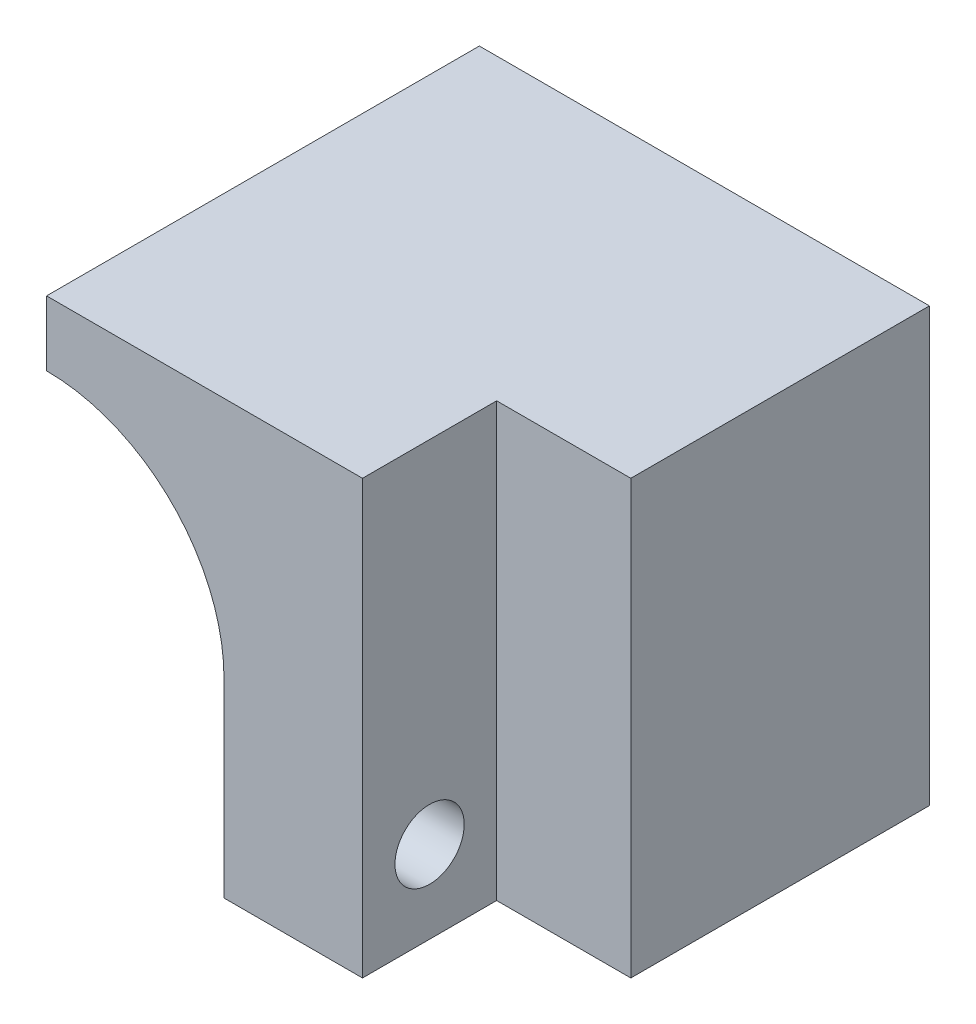
ISO-10303-21;
HEADER;
FILE_DESCRIPTION(('STEP AP214'),'2;1');
FILE_NAME('part.step','',(''),(''),'','','');
FILE_SCHEMA(('AUTOMOTIVE_DESIGN { 1 0 10303 214 1 1 1 1 }'));
ENDSEC;
DATA;
#1=APPLICATION_CONTEXT('core data for automotive mechanical design processes');
#2=APPLICATION_PROTOCOL_DEFINITION('international standard','automotive_design',2000,#1);
#3=PRODUCT_CONTEXT('',#1,'mechanical');
#4=PRODUCT('Part','Part','',(#3));
#5=PRODUCT_RELATED_PRODUCT_CATEGORY('part','',(#4));
#6=PRODUCT_DEFINITION_FORMATION('','',#4);
#7=PRODUCT_DEFINITION_CONTEXT('part definition',#1,'design');
#8=PRODUCT_DEFINITION('design','',#6,#7);
#9=PRODUCT_DEFINITION_SHAPE('','',#8);
#10=(LENGTH_UNIT() NAMED_UNIT(*) SI_UNIT(.MILLI.,.METRE.));
#11=(NAMED_UNIT(*) PLANE_ANGLE_UNIT() SI_UNIT($,.RADIAN.));
#12=(NAMED_UNIT(*) SI_UNIT($,.STERADIAN.) SOLID_ANGLE_UNIT());
#13=UNCERTAINTY_MEASURE_WITH_UNIT(LENGTH_MEASURE(1.E-05),#10,'distance_accuracy_value','');
#14=(GEOMETRIC_REPRESENTATION_CONTEXT(3) GLOBAL_UNCERTAINTY_ASSIGNED_CONTEXT((#13)) GLOBAL_UNIT_ASSIGNED_CONTEXT((#10,
#11,#12)) REPRESENTATION_CONTEXT('',''));
#15=CARTESIAN_POINT('',(0.,0.,0.));
#16=DIRECTION('',(0.,0.,1.));
#17=DIRECTION('',(1.,0.,0.));
#18=AXIS2_PLACEMENT_3D('',#15,#16,#17);
#19=CARTESIAN_POINT('',(-0.00104999999999897,-16.2,16.9));
#20=DIRECTION('',(1.,0.,0.));
#21=DIRECTION('',(0.,0.,-1.));
#22=AXIS2_PLACEMENT_3D('',#19,#20,#21);
#23=CYLINDRICAL_SURFACE('',#22,1.6);
#24=CARTESIAN_POINT('',(14.6,-16.2,16.9));
#25=DIRECTION('',(1.,0.,0.));
#26=DIRECTION('',(0.,0.,-1.));
#27=AXIS2_PLACEMENT_3D('',#24,#25,#26);
#28=CIRCLE('',#27,1.6);
#29=CARTESIAN_POINT('',(14.6,-16.2,15.3));
#30=VERTEX_POINT('',#29);
#31=EDGE_CURVE('E195',#30,#30,#28,.T.);
#32=ORIENTED_EDGE('',*,*,#31,.T.);
#33=EDGE_LOOP('',(#32));
#34=FACE_BOUND('',#33,.T.);
#35=CARTESIAN_POINT('',(11.2,-16.2,16.9));
#36=DIRECTION('',(-1.,0.,0.));
#37=DIRECTION('',(0.,0.,1.));
#38=AXIS2_PLACEMENT_3D('',#35,#36,#37);
#39=CIRCLE('',#38,1.6);
#40=CARTESIAN_POINT('',(11.2,-16.2,18.5));
#41=VERTEX_POINT('',#40);
#42=EDGE_CURVE('E35',#41,#41,#39,.F.);
#43=ORIENTED_EDGE('',*,*,#42,.F.);
#44=EDGE_LOOP('',(#43));
#45=FACE_BOUND('',#44,.T.);
#46=ADVANCED_FACE('F31',(#34,#45),#23,.F.);
#47=CARTESIAN_POINT('',(0.,-11.2,13.8));
#48=DIRECTION('',(0.,0.,-1.));
#49=DIRECTION('',(-1.,0.,0.));
#50=AXIS2_PLACEMENT_3D('',#47,#48,#49);
#51=PLANE('',#50);
#52=DIRECTION('',(0.,1.,0.));
#53=VECTOR('',#52,1.);
#54=CARTESIAN_POINT('',(14.6,-20.,13.8));
#55=LINE('',#54,#53);
#56=CARTESIAN_POINT('',(14.6,-20.,13.8));
#57=VERTEX_POINT('',#56);
#58=CARTESIAN_POINT('',(14.6,0.,13.8));
#59=VERTEX_POINT('',#58);
#60=EDGE_CURVE('E56',#57,#59,#55,.T.);
#61=ORIENTED_EDGE('',*,*,#60,.F.);
#62=DIRECTION('',(1.,0.,0.));
#63=VECTOR('',#62,1.);
#64=CARTESIAN_POINT('',(8.2,-20.,13.8));
#65=LINE('',#64,#63);
#66=CARTESIAN_POINT('',(20.8,-20.,13.8));
#67=VERTEX_POINT('',#66);
#68=EDGE_CURVE('E222',#57,#67,#65,.T.);
#69=ORIENTED_EDGE('',*,*,#68,.T.);
#70=DIRECTION('',(0.,1.,0.));
#71=VECTOR('',#70,1.);
#72=CARTESIAN_POINT('',(20.8,-20.,13.8));
#73=LINE('',#72,#71);
#74=CARTESIAN_POINT('',(20.8,0.,13.8));
#75=VERTEX_POINT('',#74);
#76=EDGE_CURVE('E263',#67,#75,#73,.T.);
#77=ORIENTED_EDGE('',*,*,#76,.T.);
#78=DIRECTION('',(-1.,0.,0.));
#79=VECTOR('',#78,1.);
#80=CARTESIAN_POINT('',(20.8,0.,13.8));
#81=LINE('',#80,#79);
#82=EDGE_CURVE('E242',#75,#59,#81,.T.);
#83=ORIENTED_EDGE('',*,*,#82,.T.);
#84=EDGE_LOOP('',(#61,#69,#77,#83));
#85=FACE_BOUND('',#84,.T.);
#86=ADVANCED_FACE('F317',(#85),#51,.F.);
#87=CARTESIAN_POINT('',(0.,0.,2.));
#88=DIRECTION('',(1.,0.,0.));
#89=DIRECTION('',(0.,1.,0.));
#90=AXIS2_PLACEMENT_3D('',#87,#88,#89);
#91=PLANE('',#90);
#92=DIRECTION('',(0.,-1.,0.));
#93=VECTOR('',#92,1.);
#94=CARTESIAN_POINT('',(0.,0.,0.));
#95=LINE('',#94,#93);
#96=CARTESIAN_POINT('',(0.,0.,0.));
#97=VERTEX_POINT('',#96);
#98=CARTESIAN_POINT('',(0.,-20.,0.));
#99=VERTEX_POINT('',#98);
#100=EDGE_CURVE('E253',#97,#99,#95,.T.);
#101=ORIENTED_EDGE('',*,*,#100,.T.);
#102=DIRECTION('',(0.,0.,-1.));
#103=VECTOR('',#102,1.);
#104=CARTESIAN_POINT('',(0.,-20.,2.));
#105=LINE('',#104,#103);
#106=CARTESIAN_POINT('',(0.,-20.,2.));
#107=VERTEX_POINT('',#106);
#108=EDGE_CURVE('E11',#107,#99,#105,.T.);
#109=ORIENTED_EDGE('',*,*,#108,.F.);
#110=DIRECTION('',(0.,-1.,0.));
#111=VECTOR('',#110,1.);
#112=CARTESIAN_POINT('',(0.,0.,2.));
#113=LINE('',#112,#111);
#114=CARTESIAN_POINT('',(0.,-3.,2.));
#115=VERTEX_POINT('',#114);
#116=EDGE_CURVE('E268',#115,#107,#113,.T.);
#117=ORIENTED_EDGE('',*,*,#116,.F.);
#118=DIRECTION('',(0.,0.,-1.));
#119=VECTOR('',#118,1.);
#120=CARTESIAN_POINT('',(0.,-3.,13.8));
#121=LINE('',#120,#119);
#122=CARTESIAN_POINT('',(0.,-3.,20.));
#123=VERTEX_POINT('',#122);
#124=EDGE_CURVE('E251',#123,#115,#121,.T.);
#125=ORIENTED_EDGE('',*,*,#124,.F.);
#126=DIRECTION('',(0.,-1.,0.));
#127=VECTOR('',#126,1.);
#128=CARTESIAN_POINT('',(0.,0.,20.));
#129=LINE('',#128,#127);
#130=CARTESIAN_POINT('',(0.,0.,20.));
#131=VERTEX_POINT('',#130);
#132=EDGE_CURVE('E198',#131,#123,#129,.T.);
#133=ORIENTED_EDGE('',*,*,#132,.F.);
#134=DIRECTION('',(0.,0.,-1.));
#135=VECTOR('',#134,1.);
#136=CARTESIAN_POINT('',(0.,0.,2.));
#137=LINE('',#136,#135);
#138=EDGE_CURVE('E276',#131,#97,#137,.T.);
#139=ORIENTED_EDGE('',*,*,#138,.T.);
#140=EDGE_LOOP('',(#101,#109,#117,#125,#133,#139));
#141=FACE_BOUND('',#140,.T.);
#142=ADVANCED_FACE('F33',(#141),#91,.F.);
#143=CARTESIAN_POINT('',(0.,-20.,2.));
#144=DIRECTION('',(0.,1.,0.));
#145=DIRECTION('',(0.,0.,1.));
#146=AXIS2_PLACEMENT_3D('',#143,#144,#145);
#147=PLANE('',#146);
#148=DIRECTION('',(1.,0.,0.));
#149=VECTOR('',#148,1.);
#150=CARTESIAN_POINT('',(0.,-20.,0.));
#151=LINE('',#150,#149);
#152=CARTESIAN_POINT('',(20.8,-20.,0.));
#153=VERTEX_POINT('',#152);
#154=EDGE_CURVE('E282',#99,#153,#151,.T.);
#155=ORIENTED_EDGE('',*,*,#154,.T.);
#156=DIRECTION('',(0.,0.,-1.));
#157=VECTOR('',#156,1.);
#158=CARTESIAN_POINT('',(20.8,-20.,2.));
#159=LINE('',#158,#157);
#160=EDGE_CURVE('E40',#67,#153,#159,.T.);
#161=ORIENTED_EDGE('',*,*,#160,.F.);
#162=ORIENTED_EDGE('',*,*,#68,.F.);
#163=DIRECTION('',(0.,0.,-1.));
#164=VECTOR('',#163,1.);
#165=CARTESIAN_POINT('',(14.6,-20.,20.));
#166=LINE('',#165,#164);
#167=CARTESIAN_POINT('',(14.6,-20.,20.));
#168=VERTEX_POINT('',#167);
#169=EDGE_CURVE('E226',#168,#57,#166,.T.);
#170=ORIENTED_EDGE('',*,*,#169,.F.);
#171=DIRECTION('',(1.,0.,0.));
#172=VECTOR('',#171,1.);
#173=CARTESIAN_POINT('',(8.2,-20.,20.));
#174=LINE('',#173,#172);
#175=CARTESIAN_POINT('',(8.2,-20.,20.));
#176=VERTEX_POINT('',#175);
#177=EDGE_CURVE('E207',#176,#168,#174,.T.);
#178=ORIENTED_EDGE('',*,*,#177,.F.);
#179=DIRECTION('',(0.,0.,-1.));
#180=VECTOR('',#179,1.);
#181=CARTESIAN_POINT('',(8.2,-20.,13.8));
#182=LINE('',#181,#180);
#183=CARTESIAN_POINT('',(8.2,-20.,2.));
#184=VERTEX_POINT('',#183);
#185=EDGE_CURVE('E258',#176,#184,#182,.T.);
#186=ORIENTED_EDGE('',*,*,#185,.T.);
#187=DIRECTION('',(1.,0.,0.));
#188=VECTOR('',#187,1.);
#189=CARTESIAN_POINT('',(0.,-20.,2.));
#190=LINE('',#189,#188);
#191=EDGE_CURVE('E246',#107,#184,#190,.T.);
#192=ORIENTED_EDGE('',*,*,#191,.F.);
#193=ORIENTED_EDGE('',*,*,#108,.T.);
#194=EDGE_LOOP('',(#155,#161,#162,#170,#178,#186,#192,#193));
#195=FACE_BOUND('',#194,.T.);
#196=ADVANCED_FACE('F296',(#195),#147,.F.);
#197=CARTESIAN_POINT('',(20.8,0.,2.));
#198=DIRECTION('',(-1.,0.,0.));
#199=DIRECTION('',(0.,-1.,0.));
#200=AXIS2_PLACEMENT_3D('',#197,#198,#199);
#201=PLANE('',#200);
#202=DIRECTION('',(0.,1.,0.));
#203=VECTOR('',#202,1.);
#204=CARTESIAN_POINT('',(20.8,0.,0.));
#205=LINE('',#204,#203);
#206=CARTESIAN_POINT('',(20.8,0.,0.));
#207=VERTEX_POINT('',#206);
#208=EDGE_CURVE('E280',#153,#207,#205,.T.);
#209=ORIENTED_EDGE('',*,*,#208,.T.);
#210=DIRECTION('',(0.,0.,-1.));
#211=VECTOR('',#210,1.);
#212=CARTESIAN_POINT('',(20.8,0.,2.));
#213=LINE('',#212,#211);
#214=EDGE_CURVE('E273',#75,#207,#213,.T.);
#215=ORIENTED_EDGE('',*,*,#214,.F.);
#216=ORIENTED_EDGE('',*,*,#76,.F.);
#217=ORIENTED_EDGE('',*,*,#160,.T.);
#218=EDGE_LOOP('',(#209,#215,#216,#217));
#219=FACE_BOUND('',#218,.T.);
#220=ADVANCED_FACE('F316',(#219),#201,.F.);
#221=CARTESIAN_POINT('',(0.,0.,2.));
#222=DIRECTION('',(0.,-1.,0.));
#223=DIRECTION('',(0.,0.,-1.));
#224=AXIS2_PLACEMENT_3D('',#221,#222,#223);
#225=PLANE('',#224);
#226=DIRECTION('',(-1.,0.,0.));
#227=VECTOR('',#226,1.);
#228=CARTESIAN_POINT('',(0.,0.,0.));
#229=LINE('',#228,#227);
#230=EDGE_CURVE('E269',#207,#97,#229,.T.);
#231=ORIENTED_EDGE('',*,*,#230,.T.);
#232=ORIENTED_EDGE('',*,*,#138,.F.);
#233=DIRECTION('',(-1.,0.,0.));
#234=VECTOR('',#233,1.);
#235=CARTESIAN_POINT('',(14.6,0.,20.));
#236=LINE('',#235,#234);
#237=CARTESIAN_POINT('',(14.6,0.,20.));
#238=VERTEX_POINT('',#237);
#239=EDGE_CURVE('E211',#238,#131,#236,.T.);
#240=ORIENTED_EDGE('',*,*,#239,.F.);
#241=DIRECTION('',(0.,0.,-1.));
#242=VECTOR('',#241,1.);
#243=CARTESIAN_POINT('',(14.6,0.,20.));
#244=LINE('',#243,#242);
#245=EDGE_CURVE('E214',#238,#59,#244,.T.);
#246=ORIENTED_EDGE('',*,*,#245,.T.);
#247=ORIENTED_EDGE('',*,*,#82,.F.);
#248=ORIENTED_EDGE('',*,*,#214,.T.);
#249=EDGE_LOOP('',(#231,#232,#240,#246,#247,#248));
#250=FACE_BOUND('',#249,.T.);
#251=ADVANCED_FACE('F311',(#250),#225,.F.);
#252=CARTESIAN_POINT('',(0.,-20.,2.));
#253=DIRECTION('',(0.,0.,1.));
#254=DIRECTION('',(1.,0.,0.));
#255=AXIS2_PLACEMENT_3D('',#252,#253,#254);
#256=PLANE('',#255);
#257=DIRECTION('',(0.,-1.,0.));
#258=VECTOR('',#257,1.);
#259=CARTESIAN_POINT('',(8.2,-11.2,2.));
#260=LINE('',#259,#258);
#261=CARTESIAN_POINT('',(8.2,-11.2,2.));
#262=VERTEX_POINT('',#261);
#263=EDGE_CURVE('E236',#262,#184,#260,.T.);
#264=ORIENTED_EDGE('',*,*,#263,.F.);
#265=CARTESIAN_POINT('',(0.,-11.2,2.));
#266=DIRECTION('',(0.,0.,-1.));
#267=DIRECTION('',(-1.,0.,0.));
#268=AXIS2_PLACEMENT_3D('',#265,#266,#267);
#269=CIRCLE('',#268,8.2);
#270=EDGE_CURVE('E230',#115,#262,#269,.T.);
#271=ORIENTED_EDGE('',*,*,#270,.F.);
#272=ORIENTED_EDGE('',*,*,#116,.T.);
#273=ORIENTED_EDGE('',*,*,#191,.T.);
#274=EDGE_LOOP('',(#264,#271,#272,#273));
#275=FACE_BOUND('',#274,.T.);
#276=ADVANCED_FACE('F300',(#275),#256,.T.);
#277=CARTESIAN_POINT('',(0.,-20.,0.));
#278=DIRECTION('',(0.,0.,1.));
#279=DIRECTION('',(1.,0.,0.));
#280=AXIS2_PLACEMENT_3D('',#277,#278,#279);
#281=PLANE('',#280);
#282=ORIENTED_EDGE('',*,*,#100,.F.);
#283=ORIENTED_EDGE('',*,*,#230,.F.);
#284=ORIENTED_EDGE('',*,*,#208,.F.);
#285=ORIENTED_EDGE('',*,*,#154,.F.);
#286=EDGE_LOOP('',(#282,#283,#284,#285));
#287=FACE_BOUND('',#286,.T.);
#288=ADVANCED_FACE('F291',(#287),#281,.F.);
#289=CARTESIAN_POINT('',(0.,-11.2,13.8));
#290=DIRECTION('',(0.,0.,-1.));
#291=DIRECTION('',(-1.,0.,0.));
#292=AXIS2_PLACEMENT_3D('',#289,#290,#291);
#293=CYLINDRICAL_SURFACE('',#292,8.2);
#294=ORIENTED_EDGE('',*,*,#270,.T.);
#295=DIRECTION('',(0.,0.,-1.));
#296=VECTOR('',#295,1.);
#297=CARTESIAN_POINT('',(8.2,-11.2,13.8));
#298=LINE('',#297,#296);
#299=CARTESIAN_POINT('',(8.2,-11.2,20.));
#300=VERTEX_POINT('',#299);
#301=EDGE_CURVE('E254',#300,#262,#298,.T.);
#302=ORIENTED_EDGE('',*,*,#301,.F.);
#303=CARTESIAN_POINT('',(0.,-11.2,20.));
#304=DIRECTION('',(0.,0.,-1.));
#305=DIRECTION('',(1.,0.,0.));
#306=AXIS2_PLACEMENT_3D('',#303,#304,#305);
#307=CIRCLE('',#306,8.2);
#308=EDGE_CURVE('E201',#123,#300,#307,.T.);
#309=ORIENTED_EDGE('',*,*,#308,.F.);
#310=ORIENTED_EDGE('',*,*,#124,.T.);
#311=EDGE_LOOP('',(#294,#302,#309,#310));
#312=FACE_BOUND('',#311,.T.);
#313=ADVANCED_FACE('F305',(#312),#293,.F.);
#314=CARTESIAN_POINT('',(8.2,-11.2,13.8));
#315=DIRECTION('',(1.,0.,0.));
#316=DIRECTION('',(0.,1.,0.));
#317=AXIS2_PLACEMENT_3D('',#314,#315,#316);
#318=PLANE('',#317);
#319=DIRECTION('',(0.,0.5,0.866025403784438));
#320=VECTOR('',#319,1.);
#321=CARTESIAN_POINT('',(8.2,-19.4908965343809,16.9));
#322=LINE('',#321,#320);
#323=CARTESIAN_POINT('',(8.2,-19.4908965343809,16.9));
#324=VERTEX_POINT('',#323);
#325=CARTESIAN_POINT('',(8.2,-17.8454482671904,19.75));
#326=VERTEX_POINT('',#325);
#327=EDGE_CURVE('E176',#324,#326,#322,.T.);
#328=ORIENTED_EDGE('',*,*,#327,.F.);
#329=DIRECTION('',(0.,-0.5,0.866025403784439));
#330=VECTOR('',#329,1.);
#331=CARTESIAN_POINT('',(8.2,-17.8454482671904,14.05));
#332=LINE('',#331,#330);
#333=CARTESIAN_POINT('',(8.2,-17.8454482671904,14.05));
#334=VERTEX_POINT('',#333);
#335=EDGE_CURVE('E48',#334,#324,#332,.T.);
#336=ORIENTED_EDGE('',*,*,#335,.F.);
#337=DIRECTION('',(0.,-1.,0.));
#338=VECTOR('',#337,1.);
#339=CARTESIAN_POINT('',(8.2,-14.5545517328096,14.05));
#340=LINE('',#339,#338);
#341=CARTESIAN_POINT('',(8.2,-14.5545517328096,14.05));
#342=VERTEX_POINT('',#341);
#343=EDGE_CURVE('E162',#342,#334,#340,.T.);
#344=ORIENTED_EDGE('',*,*,#343,.F.);
#345=DIRECTION('',(0.,-0.500000000000001,-0.866025403784438));
#346=VECTOR('',#345,1.);
#347=CARTESIAN_POINT('',(8.2,-12.9091034656191,16.9));
#348=LINE('',#347,#346);
#349=CARTESIAN_POINT('',(8.2,-12.9091034656191,16.9));
#350=VERTEX_POINT('',#349);
#351=EDGE_CURVE('E165',#350,#342,#348,.T.);
#352=ORIENTED_EDGE('',*,*,#351,.F.);
#353=DIRECTION('',(0.,0.5,-0.866025403784439));
#354=VECTOR('',#353,1.);
#355=CARTESIAN_POINT('',(8.2,-14.5545517328096,19.75));
#356=LINE('',#355,#354);
#357=CARTESIAN_POINT('',(8.2,-14.5545517328096,19.75));
#358=VERTEX_POINT('',#357);
#359=EDGE_CURVE('E181',#358,#350,#356,.T.);
#360=ORIENTED_EDGE('',*,*,#359,.F.);
#361=DIRECTION('',(0.,1.,0.));
#362=VECTOR('',#361,1.);
#363=CARTESIAN_POINT('',(8.2,-17.8454482671904,19.75));
#364=LINE('',#363,#362);
#365=EDGE_CURVE('E178',#326,#358,#364,.T.);
#366=ORIENTED_EDGE('',*,*,#365,.F.);
#367=EDGE_LOOP('',(#328,#336,#344,#352,#360,#366));
#368=FACE_BOUND('',#367,.T.);
#369=ORIENTED_EDGE('',*,*,#263,.T.);
#370=ORIENTED_EDGE('',*,*,#185,.F.);
#371=DIRECTION('',(0.,-1.,0.));
#372=VECTOR('',#371,1.);
#373=CARTESIAN_POINT('',(8.2,-11.2,20.));
#374=LINE('',#373,#372);
#375=EDGE_CURVE('E204',#300,#176,#374,.T.);
#376=ORIENTED_EDGE('',*,*,#375,.F.);
#377=ORIENTED_EDGE('',*,*,#301,.T.);
#378=EDGE_LOOP('',(#369,#370,#376,#377));
#379=FACE_BOUND('',#378,.T.);
#380=ADVANCED_FACE('F302',(#368,#379),#318,.F.);
#381=CARTESIAN_POINT('',(14.6,-20.,20.));
#382=DIRECTION('',(-1.,0.,0.));
#383=DIRECTION('',(0.,0.,1.));
#384=AXIS2_PLACEMENT_3D('',#381,#382,#383);
#385=PLANE('',#384);
#386=ORIENTED_EDGE('',*,*,#31,.F.);
#387=EDGE_LOOP('',(#386));
#388=FACE_BOUND('',#387,.T.);
#389=ORIENTED_EDGE('',*,*,#60,.T.);
#390=ORIENTED_EDGE('',*,*,#245,.F.);
#391=DIRECTION('',(0.,1.,0.));
#392=VECTOR('',#391,1.);
#393=CARTESIAN_POINT('',(14.6,-20.,20.));
#394=LINE('',#393,#392);
#395=EDGE_CURVE('E209',#168,#238,#394,.T.);
#396=ORIENTED_EDGE('',*,*,#395,.F.);
#397=ORIENTED_EDGE('',*,*,#169,.T.);
#398=EDGE_LOOP('',(#389,#390,#396,#397));
#399=FACE_BOUND('',#398,.T.);
#400=ADVANCED_FACE('F319',(#388,#399),#385,.F.);
#401=CARTESIAN_POINT('',(0.,-11.2,20.));
#402=DIRECTION('',(0.,0.,1.));
#403=DIRECTION('',(1.,0.,0.));
#404=AXIS2_PLACEMENT_3D('',#401,#402,#403);
#405=PLANE('',#404);
#406=ORIENTED_EDGE('',*,*,#132,.T.);
#407=ORIENTED_EDGE('',*,*,#308,.T.);
#408=ORIENTED_EDGE('',*,*,#375,.T.);
#409=ORIENTED_EDGE('',*,*,#177,.T.);
#410=ORIENTED_EDGE('',*,*,#395,.T.);
#411=ORIENTED_EDGE('',*,*,#239,.T.);
#412=EDGE_LOOP('',(#406,#407,#408,#409,#410,#411));
#413=FACE_BOUND('',#412,.T.);
#414=ADVANCED_FACE('F307',(#413),#405,.T.);
#415=CARTESIAN_POINT('',(11.2,-19.4908965343809,16.9));
#416=DIRECTION('',(-1.,0.,0.));
#417=DIRECTION('',(0.,0.,1.));
#418=AXIS2_PLACEMENT_3D('',#415,#416,#417);
#419=PLANE('',#418);
#420=DIRECTION('',(0.,-0.5,0.866025403784439));
#421=VECTOR('',#420,1.);
#422=CARTESIAN_POINT('',(11.2,-17.8454482671904,14.05));
#423=LINE('',#422,#421);
#424=CARTESIAN_POINT('',(11.2,-17.8454482671904,14.05));
#425=VERTEX_POINT('',#424);
#426=CARTESIAN_POINT('',(11.2,-19.4908965343809,16.9));
#427=VERTEX_POINT('',#426);
#428=EDGE_CURVE('E142',#425,#427,#423,.T.);
#429=ORIENTED_EDGE('',*,*,#428,.T.);
#430=DIRECTION('',(0.,0.5,0.866025403784438));
#431=VECTOR('',#430,1.);
#432=CARTESIAN_POINT('',(11.2,-19.4908965343809,16.9));
#433=LINE('',#432,#431);
#434=CARTESIAN_POINT('',(11.2,-17.8454482671904,19.75));
#435=VERTEX_POINT('',#434);
#436=EDGE_CURVE('E151',#427,#435,#433,.T.);
#437=ORIENTED_EDGE('',*,*,#436,.T.);
#438=DIRECTION('',(0.,1.,0.));
#439=VECTOR('',#438,1.);
#440=CARTESIAN_POINT('',(11.2,-17.8454482671904,19.75));
#441=LINE('',#440,#439);
#442=CARTESIAN_POINT('',(11.2,-14.5545517328096,19.75));
#443=VERTEX_POINT('',#442);
#444=EDGE_CURVE('E156',#435,#443,#441,.T.);
#445=ORIENTED_EDGE('',*,*,#444,.T.);
#446=DIRECTION('',(0.,0.5,-0.866025403784439));
#447=VECTOR('',#446,1.);
#448=CARTESIAN_POINT('',(11.2,-14.5545517328096,19.75));
#449=LINE('',#448,#447);
#450=CARTESIAN_POINT('',(11.2,-12.9091034656191,16.9));
#451=VERTEX_POINT('',#450);
#452=EDGE_CURVE('E169',#443,#451,#449,.T.);
#453=ORIENTED_EDGE('',*,*,#452,.T.);
#454=DIRECTION('',(0.,-0.500000000000001,-0.866025403784438));
#455=VECTOR('',#454,1.);
#456=CARTESIAN_POINT('',(11.2,-12.9091034656191,16.9));
#457=LINE('',#456,#455);
#458=CARTESIAN_POINT('',(11.2,-14.5545517328096,14.05));
#459=VERTEX_POINT('',#458);
#460=EDGE_CURVE('E172',#451,#459,#457,.T.);
#461=ORIENTED_EDGE('',*,*,#460,.T.);
#462=DIRECTION('',(0.,-1.,0.));
#463=VECTOR('',#462,1.);
#464=CARTESIAN_POINT('',(11.2,-14.5545517328096,14.05));
#465=LINE('',#464,#463);
#466=EDGE_CURVE('E148',#459,#425,#465,.T.);
#467=ORIENTED_EDGE('',*,*,#466,.T.);
#468=EDGE_LOOP('',(#429,#437,#445,#453,#461,#467));
#469=FACE_BOUND('',#468,.T.);
#470=ORIENTED_EDGE('',*,*,#42,.T.);
#471=EDGE_LOOP('',(#470));
#472=FACE_BOUND('',#471,.T.);
#473=ADVANCED_FACE('F158',(#469,#472),#419,.T.);
#474=CARTESIAN_POINT('',(11.2,-17.8454482671904,14.05));
#475=DIRECTION('',(0.,-0.866025403784439,-0.5));
#476=DIRECTION('',(0.,0.5,-0.866025403784439));
#477=AXIS2_PLACEMENT_3D('',#474,#475,#476);
#478=PLANE('',#477);
#479=ORIENTED_EDGE('',*,*,#335,.T.);
#480=DIRECTION('',(-1.,0.,0.));
#481=VECTOR('',#480,1.);
#482=CARTESIAN_POINT('',(11.2,-19.4908965343809,16.9));
#483=LINE('',#482,#481);
#484=EDGE_CURVE('E138',#427,#324,#483,.T.);
#485=ORIENTED_EDGE('',*,*,#484,.F.);
#486=ORIENTED_EDGE('',*,*,#428,.F.);
#487=DIRECTION('',(-1.,0.,0.));
#488=VECTOR('',#487,1.);
#489=CARTESIAN_POINT('',(11.2,-17.8454482671904,14.05));
#490=LINE('',#489,#488);
#491=EDGE_CURVE('E186',#425,#334,#490,.T.);
#492=ORIENTED_EDGE('',*,*,#491,.T.);
#493=EDGE_LOOP('',(#479,#485,#486,#492));
#494=FACE_BOUND('',#493,.T.);
#495=ADVANCED_FACE('F140',(#494),#478,.F.);
#496=CARTESIAN_POINT('',(11.2,-14.5545517328096,14.05));
#497=DIRECTION('',(0.,0.,-1.));
#498=DIRECTION('',(-1.,0.,0.));
#499=AXIS2_PLACEMENT_3D('',#496,#497,#498);
#500=PLANE('',#499);
#501=ORIENTED_EDGE('',*,*,#343,.T.);
#502=ORIENTED_EDGE('',*,*,#491,.F.);
#503=ORIENTED_EDGE('',*,*,#466,.F.);
#504=DIRECTION('',(-1.,0.,0.));
#505=VECTOR('',#504,1.);
#506=CARTESIAN_POINT('',(11.2,-14.5545517328096,14.05));
#507=LINE('',#506,#505);
#508=EDGE_CURVE('E188',#459,#342,#507,.T.);
#509=ORIENTED_EDGE('',*,*,#508,.T.);
#510=EDGE_LOOP('',(#501,#502,#503,#509));
#511=FACE_BOUND('',#510,.T.);
#512=ADVANCED_FACE('F342',(#511),#500,.F.);
#513=CARTESIAN_POINT('',(11.2,-12.9091034656191,16.9));
#514=DIRECTION('',(0.,0.866025403784438,-0.5));
#515=DIRECTION('',(0.,0.500000000000001,0.866025403784438));
#516=AXIS2_PLACEMENT_3D('',#513,#514,#515);
#517=PLANE('',#516);
#518=ORIENTED_EDGE('',*,*,#351,.T.);
#519=ORIENTED_EDGE('',*,*,#508,.F.);
#520=ORIENTED_EDGE('',*,*,#460,.F.);
#521=DIRECTION('',(-1.,0.,0.));
#522=VECTOR('',#521,1.);
#523=CARTESIAN_POINT('',(11.2,-12.9091034656191,16.9));
#524=LINE('',#523,#522);
#525=EDGE_CURVE('E190',#451,#350,#524,.T.);
#526=ORIENTED_EDGE('',*,*,#525,.T.);
#527=EDGE_LOOP('',(#518,#519,#520,#526));
#528=FACE_BOUND('',#527,.T.);
#529=ADVANCED_FACE('F352',(#528),#517,.F.);
#530=CARTESIAN_POINT('',(11.2,-14.5545517328096,19.75));
#531=DIRECTION('',(0.,0.866025403784439,0.5));
#532=DIRECTION('',(0.,-0.5,0.866025403784439));
#533=AXIS2_PLACEMENT_3D('',#530,#531,#532);
#534=PLANE('',#533);
#535=ORIENTED_EDGE('',*,*,#359,.T.);
#536=ORIENTED_EDGE('',*,*,#525,.F.);
#537=ORIENTED_EDGE('',*,*,#452,.F.);
#538=DIRECTION('',(-1.,0.,0.));
#539=VECTOR('',#538,1.);
#540=CARTESIAN_POINT('',(11.2,-14.5545517328096,19.75));
#541=LINE('',#540,#539);
#542=EDGE_CURVE('E192',#443,#358,#541,.T.);
#543=ORIENTED_EDGE('',*,*,#542,.T.);
#544=EDGE_LOOP('',(#535,#536,#537,#543));
#545=FACE_BOUND('',#544,.T.);
#546=ADVANCED_FACE('F348',(#545),#534,.F.);
#547=CARTESIAN_POINT('',(11.2,-17.8454482671904,19.75));
#548=DIRECTION('',(0.,0.,1.));
#549=DIRECTION('',(1.,0.,0.));
#550=AXIS2_PLACEMENT_3D('',#547,#548,#549);
#551=PLANE('',#550);
#552=ORIENTED_EDGE('',*,*,#365,.T.);
#553=ORIENTED_EDGE('',*,*,#542,.F.);
#554=ORIENTED_EDGE('',*,*,#444,.F.);
#555=DIRECTION('',(-1.,0.,0.));
#556=VECTOR('',#555,1.);
#557=CARTESIAN_POINT('',(11.2,-17.8454482671904,19.75));
#558=LINE('',#557,#556);
#559=EDGE_CURVE('E147',#435,#326,#558,.T.);
#560=ORIENTED_EDGE('',*,*,#559,.T.);
#561=EDGE_LOOP('',(#552,#553,#554,#560));
#562=FACE_BOUND('',#561,.T.);
#563=ADVANCED_FACE('F345',(#562),#551,.F.);
#564=CARTESIAN_POINT('',(11.2,-19.4908965343809,16.9));
#565=DIRECTION('',(0.,-0.866025403784438,0.5));
#566=DIRECTION('',(0.,-0.5,-0.866025403784439));
#567=AXIS2_PLACEMENT_3D('',#564,#565,#566);
#568=PLANE('',#567);
#569=ORIENTED_EDGE('',*,*,#327,.T.);
#570=ORIENTED_EDGE('',*,*,#559,.F.);
#571=ORIENTED_EDGE('',*,*,#436,.F.);
#572=ORIENTED_EDGE('',*,*,#484,.T.);
#573=EDGE_LOOP('',(#569,#570,#571,#572));
#574=FACE_BOUND('',#573,.T.);
#575=ADVANCED_FACE('F152',(#574),#568,.F.);
#576=CLOSED_SHELL('',(#46,#86,#142,#196,#220,#251,#276,#288,#313,#380,#400,#414,#473,#495,#512,
#529,#546,#563,#575));
#577=MANIFOLD_SOLID_BREP('B2',#576);
#578=ADVANCED_BREP_SHAPE_REPRESENTATION('',(#18,#577),#14);
#579=SHAPE_DEFINITION_REPRESENTATION(#9,#578);
ENDSEC;
END-ISO-10303-21;
